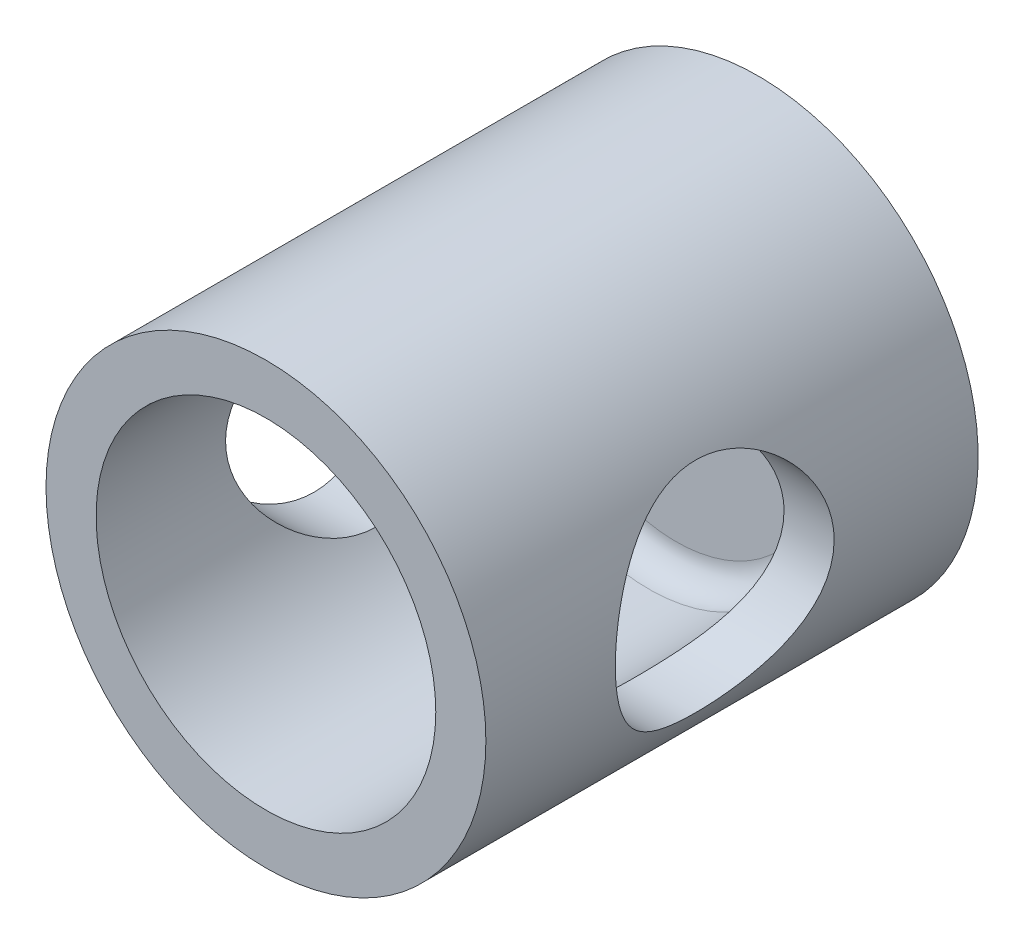
ISO-10303-21;
HEADER;
FILE_DESCRIPTION(('STEP AP214'),'2;1');
FILE_NAME('part.step','',(''),(''),'','','');
FILE_SCHEMA(('AUTOMOTIVE_DESIGN { 1 0 10303 214 1 1 1 1 }'));
ENDSEC;
DATA;
#1=APPLICATION_CONTEXT('core data for automotive mechanical design processes');
#2=APPLICATION_PROTOCOL_DEFINITION('international standard','automotive_design',2000,#1);
#3=PRODUCT_CONTEXT('',#1,'mechanical');
#4=PRODUCT('Part','Part','',(#3));
#5=PRODUCT_RELATED_PRODUCT_CATEGORY('part','',(#4));
#6=PRODUCT_DEFINITION_FORMATION('','',#4);
#7=PRODUCT_DEFINITION_CONTEXT('part definition',#1,'design');
#8=PRODUCT_DEFINITION('design','',#6,#7);
#9=PRODUCT_DEFINITION_SHAPE('','',#8);
#10=(LENGTH_UNIT() NAMED_UNIT(*) SI_UNIT(.MILLI.,.METRE.));
#11=(NAMED_UNIT(*) PLANE_ANGLE_UNIT() SI_UNIT($,.RADIAN.));
#12=(NAMED_UNIT(*) SI_UNIT($,.STERADIAN.) SOLID_ANGLE_UNIT());
#13=UNCERTAINTY_MEASURE_WITH_UNIT(LENGTH_MEASURE(1.E-05),#10,'distance_accuracy_value','');
#14=(GEOMETRIC_REPRESENTATION_CONTEXT(3) GLOBAL_UNCERTAINTY_ASSIGNED_CONTEXT((#13)) GLOBAL_UNIT_ASSIGNED_CONTEXT((#10,
#11,#12)) REPRESENTATION_CONTEXT('',''));
#15=CARTESIAN_POINT('',(0.,0.,0.));
#16=DIRECTION('',(0.,0.,1.));
#17=DIRECTION('',(1.,0.,0.));
#18=AXIS2_PLACEMENT_3D('',#15,#16,#17);
#19=CARTESIAN_POINT('',(-21.,0.,9.26602700813621));
#20=DIRECTION('',(1.,0.,0.));
#21=DIRECTION('',(0.,0.,-1.));
#22=AXIS2_PLACEMENT_3D('',#19,#20,#21);
#23=CYLINDRICAL_SURFACE('',#22,4.);
#24=CARTESIAN_POINT('',(-6.21027153803007,0.,5.26602700813621));
#25=CARTESIAN_POINT('',(-6.21027419475745,0.10116179511137,5.26602419368673));
#26=CARTESIAN_POINT('',(-6.20779578951268,0.202296836657,5.26986785153655));
#27=CARTESIAN_POINT('',(-6.1979513499279,0.403779242184816,5.28517721498518));
#28=CARTESIAN_POINT('',(-6.19058433900414,0.504126444728934,5.29664444352528));
#29=CARTESIAN_POINT('',(-6.17113313025147,0.703280502086392,5.32704890353996));
#30=CARTESIAN_POINT('',(-6.15904600541067,0.802086361476096,5.34599077022403));
#31=CARTESIAN_POINT('',(-6.13045066881727,0.997402959620375,5.39107522828379));
#32=CARTESIAN_POINT('',(-6.1139406187714,1.09391272585213,5.41722081385854));
#33=CARTESIAN_POINT('',(-6.05850504948021,1.37803111894126,5.50568715338015));
#34=CARTESIAN_POINT('',(-6.01355262412691,1.56140490993851,5.57822197187787));
#35=CARTESIAN_POINT('',(-5.91125922641458,1.91260612200056,5.74749820780275));
#36=CARTESIAN_POINT('',(-5.85391741903108,2.08043249410441,5.84424125689536));
#37=CARTESIAN_POINT('',(-5.72592839409287,2.41147736878317,6.06791891252311));
#38=CARTESIAN_POINT('',(-5.6545748203039,2.57318229013404,6.1966819596737));
#39=CARTESIAN_POINT('',(-5.50767741856737,2.87420381321784,6.47653387813265));
#40=CARTESIAN_POINT('',(-5.43212790981473,3.01348901585702,6.62765350171328));
#41=CARTESIAN_POINT('',(-5.31494961654037,3.21339900119603,6.88109880899431));
#42=CARTESIAN_POINT('',(-5.27260427658279,3.28222562504596,6.9767250943138));
#43=CARTESIAN_POINT('',(-5.18988119137982,3.41152430600391,7.17426605192657));
#44=CARTESIAN_POINT('',(-5.14950385022683,3.47199465194262,7.27618200603341));
#45=CARTESIAN_POINT('',(-5.03353859027783,3.63997393581471,7.59065525591866));
#46=CARTESIAN_POINT('',(-4.9628689263148,3.73445451394399,7.81244584783822));
#47=CARTESIAN_POINT('',(-4.86328418910194,3.8627299502056,8.21218554453294));
#48=CARTESIAN_POINT('',(-4.82823753706474,3.90604907652248,8.38558532510471));
#49=CARTESIAN_POINT('',(-4.77646449604497,3.96920260343946,8.73919781012551));
#50=CARTESIAN_POINT('',(-4.75970971604694,3.98907340233482,8.91939950613832));
#51=CARTESIAN_POINT('',(-4.74708301956282,4.00409757987669,9.28217311228656));
#52=CARTESIAN_POINT('',(-4.7512785570492,3.99917111809616,9.46475078826483));
#53=CARTESIAN_POINT('',(-4.78001287876579,3.96477098356035,9.82600361684351));
#54=CARTESIAN_POINT('',(-4.80456854952988,3.93527693454834,10.0046754036351));
#55=CARTESIAN_POINT('',(-4.86930393027865,3.85485067083263,10.347801837806));
#56=CARTESIAN_POINT('',(-4.9089616785873,3.80463040273523,10.512527957525));
#57=CARTESIAN_POINT('',(-4.99946437929397,3.68489450547158,10.8314678560019));
#58=CARTESIAN_POINT('',(-5.05031303161553,3.61537249279258,10.9856781358864));
#59=CARTESIAN_POINT('',(-5.16943092655625,3.44345588171677,11.3112153310293));
#60=CARTESIAN_POINT('',(-5.23916357829582,3.337294498445,11.4800146104514));
#61=CARTESIAN_POINT('',(-5.38188438130507,3.10190037606515,11.7993301567222));
#62=CARTESIAN_POINT('',(-5.45487634309922,2.9726400721355,11.9498242146197));
#63=CARTESIAN_POINT('',(-5.61187461512408,2.66631127958272,12.2570516185796));
#64=CARTESIAN_POINT('',(-5.6953851249832,2.48482286786562,12.409679782982));
#65=CARTESIAN_POINT('',(-5.85026918109212,2.09423349887556,12.6822708120702));
#66=CARTESIAN_POINT('',(-5.92165547025048,1.8851619482464,12.802268053573));
#67=CARTESIAN_POINT('',(-6.03223858750268,1.48772175089167,12.9841614162442));
#68=CARTESIAN_POINT('',(-6.07501102606718,1.30346190247884,13.0528591475138));
#69=CARTESIAN_POINT('',(-6.14416390327499,0.924015259424038,13.1628362983269));
#70=CARTESIAN_POINT('',(-6.17055763757704,0.728837468276994,13.2041379589233));
#71=CARTESIAN_POINT('',(-6.20458655584817,0.332151140464263,13.2572479047391));
#72=CARTESIAN_POINT('',(-6.21215622149502,0.130622957770149,13.2689531802926));
#73=CARTESIAN_POINT('',(-6.20758584553991,-0.271680719378584,13.2618571585236));
#74=CARTESIAN_POINT('',(-6.19544498822973,-0.472456182337687,13.2430545986526));
#75=CARTESIAN_POINT('',(-6.15386506618864,-0.855905836514246,13.1779519872883));
#76=CARTESIAN_POINT('',(-6.12542644934345,-1.03896553114524,13.1332407239176));
#77=CARTESIAN_POINT('',(-6.05440022046401,-1.39449139464518,13.0197244846093));
#78=CARTESIAN_POINT('',(-6.01181023775633,-1.56695578282124,12.95091547165));
#79=CARTESIAN_POINT('',(-5.91208724832325,-1.91021496490886,12.7859607499495));
#80=CARTESIAN_POINT('',(-5.85412478444299,-2.07998553522502,12.6881969830567));
#81=CARTESIAN_POINT('',(-5.72975444546384,-2.40149104860395,12.4707995946616));
#82=CARTESIAN_POINT('',(-5.66334023149179,-2.55321228756366,12.3511495285104));
#83=CARTESIAN_POINT('',(-5.51610020892713,-2.85886489252187,12.0724489386876));
#84=CARTESIAN_POINT('',(-5.43462887202774,-3.00954741402491,11.9101688869046));
#85=CARTESIAN_POINT('',(-5.27411247674773,-3.28272952122645,11.5622546495967));
#86=CARTESIAN_POINT('',(-5.19506806440456,-3.4052216581689,11.3766143115712));
#87=CARTESIAN_POINT('',(-5.05785169733432,-3.60532757449489,11.0094079507564));
#88=CARTESIAN_POINT('',(-4.9983022369782,-3.68670296295454,10.8304412660524));
#89=CARTESIAN_POINT('',(-4.9206127767023,-3.78904738889028,10.5516890632479));
#90=CARTESIAN_POINT('',(-4.89665691923493,-3.8198740119591,10.457062924984));
#91=CARTESIAN_POINT('',(-4.85347760963172,-3.87458938562093,10.264793145061));
#92=CARTESIAN_POINT('',(-4.83425177278955,-3.89848163337303,10.1671510520018));
#93=CARTESIAN_POINT('',(-4.80115820657488,-3.93916884289533,9.96841039593383));
#94=CARTESIAN_POINT('',(-4.78734813760506,-3.95588759781292,9.8672864821669));
#95=CARTESIAN_POINT('',(-4.76603542881081,-3.98153974002648,9.66339021393728));
#96=CARTESIAN_POINT('',(-4.7585326062632,-3.99047335286108,9.56061790731703));
#97=CARTESIAN_POINT('',(-4.75023262253051,-4.00035101775833,9.35448426897167));
#98=CARTESIAN_POINT('',(-4.74943062350589,-4.00130083394043,9.25112341612525));
#99=CARTESIAN_POINT('',(-4.75454904760025,-3.99521470319305,9.04483896272276));
#100=CARTESIAN_POINT('',(-4.76046887184919,-3.98817946767896,8.94191532403378));
#101=CARTESIAN_POINT('',(-4.78513764369516,-3.95860839154636,8.66622204257323));
#102=CARTESIAN_POINT('',(-4.80994912191195,-3.92869071937144,8.49471534470019));
#103=CARTESIAN_POINT('',(-4.87483310704924,-3.84786914809628,8.15980920941288));
#104=CARTESIAN_POINT('',(-4.91492089719386,-3.79694422801918,7.99641807688091));
#105=CARTESIAN_POINT('',(-5.02164784616665,-3.65524653088718,7.62561223601469));
#106=CARTESIAN_POINT('',(-5.0926767705326,-3.55679198573325,7.42239354474325));
#107=CARTESIAN_POINT('',(-5.2441982437604,-3.32934664618829,7.03767137723875));
#108=CARTESIAN_POINT('',(-5.32470518361578,-3.20030910700426,6.85620178926353));
#109=CARTESIAN_POINT('',(-5.48752737303865,-2.91242531443178,6.51499136281188));
#110=CARTESIAN_POINT('',(-5.56985254500375,-2.75321525567974,6.35556176795089));
#111=CARTESIAN_POINT('',(-5.72741114717448,-2.40834685435535,6.06435050698496));
#112=CARTESIAN_POINT('',(-5.80265114769249,-2.22271342446654,5.93254308409085));
#113=CARTESIAN_POINT('',(-5.93041544031859,-1.8523005741456,5.71510070068208));
#114=CARTESIAN_POINT('',(-5.98460240357186,-1.67030140279752,5.62575761407741));
#115=CARTESIAN_POINT('',(-6.05432278762509,-1.38642703943027,5.51259979882105));
#116=CARTESIAN_POINT('',(-6.07563222805987,-1.29001594354288,5.47836281229962));
#117=CARTESIAN_POINT('',(-6.11395227707634,-1.09408134914481,5.41719461834646));
#118=CARTESIAN_POINT('',(-6.13096387796168,-0.994558575045945,5.39026172440883));
#119=CARTESIAN_POINT('',(-6.16676738571439,-0.748345223170763,5.33382370214221));
#120=CARTESIAN_POINT('',(-6.18300637399467,-0.600300072240859,5.30846956799622));
#121=CARTESIAN_POINT('',(-6.20475680232674,-0.301483599157345,5.27457279848009));
#122=CARTESIAN_POINT('',(-6.21026758000435,-0.150712109255893,5.26603120113828));
#123=CARTESIAN_POINT('',(-6.21027153803007,0.,5.26602700813621));
#124=B_SPLINE_CURVE_WITH_KNOTS('',3,(#24,#25,#26,#27,#28,#29,#30,#31,#32,#33,#34,#35,#36,#37,
#38,#39,#40,#41,#42,#43,#44,#45,#46,#47,#48,#49,#50,#51,#52,#53,#54,#55,#56,#57,#58,#59,#60,#61,
#62,#63,#64,#65,#66,#67,#68,#69,#70,#71,#72,#73,#74,#75,#76,#77,#78,#79,#80,#81,#82,#83,#84,#85,
#86,#87,#88,#89,#90,#91,#92,#93,#94,#95,#96,#97,#98,#99,#100,#101,#102,#103,#104,#105,#106,#107,
#108,#109,#110,#111,#112,#113,#114,#115,#116,#117,#118,#119,#120,#121,#122,#123),.UNSPECIFIED.,
.T.,.F.,(4,2,2,2,2,2,2,2,2,2,2,2,2,2,2,2,2,2,2,2,2,2,2,2,2,2,2,2,2,2,2,2,2,2,2,2,2,2,2,2,2,2,2,
2,2,2,2,2,2,4),(0.,0.303336126772763,0.606732868446618,0.910318050420045,1.21402960730385,
1.81790901949754,2.42182914489841,3.07540722771112,3.72989283677029,4.10506873827853,
4.48032135350497,5.22876903870081,5.77300468699254,6.31639441493355,6.86153482679468,
7.40712782661394,7.93536190389105,8.46377088836157,9.09523846001963,9.72746468024955,
10.4780346484405,11.2278107972757,11.8289920955396,12.4296847352821,13.0324652144701,
13.6352706400046,14.2045233708391,14.7738715124838,15.3844260974564,15.995441331743,
16.7004290748437,17.4056028837979,18.0192370071596,18.3260030847592,18.6326141835282,
18.9424064020895,19.2521896455505,19.5617492133339,19.8712812035685,20.3963229210728,
20.9218913028077,21.628294194872,22.3357838367034,23.052420031869,23.7683849838101,
24.395067097135,24.7082464879726,25.0213535043906,25.4732395657141,25.9251535262078),.UNSPECIFIED.);
#125=CARTESIAN_POINT('',(-6.21027153803007,0.,5.26602700813621));
#126=VERTEX_POINT('',#125);
#127=EDGE_CURVE('E121',#126,#126,#124,.T.);
#128=ORIENTED_EDGE('',*,*,#127,.T.);
#129=EDGE_LOOP('',(#128));
#130=FACE_BOUND('',#129,.T.);
#131=CARTESIAN_POINT('',(-8.04212669637564,0.,5.26602700813621));
#132=CARTESIAN_POINT('',(-8.04212630414364,0.105257391885154,5.26602745614108));
#133=CARTESIAN_POINT('',(-8.0400552272396,0.210523337059257,5.27018673348386));
#134=CARTESIAN_POINT('',(-8.03182379375679,0.420279281347293,5.28677555528698));
#135=CARTESIAN_POINT('',(-8.02566163019231,0.524768916943047,5.29920875424864));
#136=CARTESIAN_POINT('',(-8.00939313360465,0.732301468596946,5.33222667498201));
#137=CARTESIAN_POINT('',(-7.99928108474102,0.835342062876286,5.35282321047517));
#138=CARTESIAN_POINT('',(-7.9753763105692,1.03909874101501,5.40192589415835));
#139=CARTESIAN_POINT('',(-7.96158208062805,1.13981385630429,5.43043527592869));
#140=CARTESIAN_POINT('',(-7.91529246465985,1.43658071246041,5.52713609530429));
#141=CARTESIAN_POINT('',(-7.87780328008354,1.62829732042591,5.60666951360139));
#142=CARTESIAN_POINT('',(-7.79296202979745,1.99528126781113,5.7930862618434));
#143=CARTESIAN_POINT('',(-7.74561080924149,2.17055001490891,5.89996724834382));
#144=CARTESIAN_POINT('',(-7.64205858722049,2.51164413707844,6.14539242426199));
#145=CARTESIAN_POINT('',(-7.58549690861226,2.67627045264003,6.28545255459696));
#146=CARTESIAN_POINT('',(-7.47109586233352,2.98078014207725,6.58994355143529));
#147=CARTESIAN_POINT('',(-7.41325556852754,3.12064487275159,6.75439261081889));
#148=CARTESIAN_POINT('',(-7.29772071024418,3.38246956238201,7.11828841503324));
#149=CARTESIAN_POINT('',(-7.24037608524739,3.50223999264779,7.31945040850877));
#150=CARTESIAN_POINT('',(-7.16389858978195,3.65480541730556,7.63624587567261));
#151=CARTESIAN_POINT('',(-7.13998951274712,3.70115663625523,7.74439232440346));
#152=CARTESIAN_POINT('',(-7.09624334870005,3.78435477721017,7.96505316273665));
#153=CARTESIAN_POINT('',(-7.07640386334476,3.82120730041102,8.07756493294796));
#154=CARTESIAN_POINT('',(-7.04265141642954,3.8830440926528,8.2993652330672));
#155=CARTESIAN_POINT('',(-7.02845767641738,3.90860067166185,8.40845179017485));
#156=CARTESIAN_POINT('',(-7.00498417233291,3.9505161417328,8.62885043333387));
#157=CARTESIAN_POINT('',(-6.99570181429245,3.96687988831243,8.74016131229567));
#158=CARTESIAN_POINT('',(-6.98244491458214,3.99016863652192,8.96401663973964));
#159=CARTESIAN_POINT('',(-6.97846725433724,3.99709918387807,9.07656032419477));
#160=CARTESIAN_POINT('',(-6.97598733542238,4.00142594974986,9.30188481539609));
#161=CARTESIAN_POINT('',(-6.97748456401485,3.99882306109656,9.41466559894868));
#162=CARTESIAN_POINT('',(-6.9853878617997,3.98499824234287,9.62608784934883));
#163=CARTESIAN_POINT('',(-6.99119181548553,3.97483315476114,9.72482257860045));
#164=CARTESIAN_POINT('',(-7.00679415205635,3.94726227845358,9.92096567715963));
#165=CARTESIAN_POINT('',(-7.01659379135194,3.92985421219725,10.0183736193048));
#166=CARTESIAN_POINT('',(-7.05153802190969,3.86703716999606,10.3075933855507));
#167=CARTESIAN_POINT('',(-7.08223412788531,3.81102541890858,10.4965478185559));
#168=CARTESIAN_POINT('',(-7.15565251701587,3.6713399237033,10.8664484379253));
#169=CARTESIAN_POINT('',(-7.19863844441127,3.58705182948358,11.0471052936798));
#170=CARTESIAN_POINT('',(-7.29180624888069,3.39365155775164,11.3926053378956));
#171=CARTESIAN_POINT('',(-7.34199135185085,3.28452823883726,11.5574413816071));
#172=CARTESIAN_POINT('',(-7.4514966189966,3.02864746431238,11.8883105603497));
#173=CARTESIAN_POINT('',(-7.51117350254039,2.87888771772847,12.0519058298397));
#174=CARTESIAN_POINT('',(-7.62786293929434,2.55367914950725,12.3527300015022));
#175=CARTESIAN_POINT('',(-7.68487423514056,2.37821836272971,12.4899465538616));
#176=CARTESIAN_POINT('',(-7.76530127835092,2.09433222438204,12.6759236124232));
#177=CARTESIAN_POINT('',(-7.79177849614505,1.99381419765517,12.7356734749219));
#178=CARTESIAN_POINT('',(-7.84170986949508,1.7873560899409,12.8463983619705));
#179=CARTESIAN_POINT('',(-7.86516529716083,1.68141831696652,12.8973770820387));
#180=CARTESIAN_POINT('',(-7.90836060308644,1.46486328148671,12.9900091570882));
#181=CARTESIAN_POINT('',(-7.92810195625671,1.35424789798927,13.0316662150807));
#182=CARTESIAN_POINT('',(-7.96327905157377,1.12914028513531,13.1051746577255));
#183=CARTESIAN_POINT('',(-7.97871528315954,1.01464849813882,13.1370271570772));
#184=CARTESIAN_POINT('',(-8.0037192923607,0.792305726931952,13.1882939359019));
#185=CARTESIAN_POINT('',(-8.01366528769422,0.684682950607484,13.2085156979449));
#186=CARTESIAN_POINT('',(-8.02924289618175,0.467837854718372,13.2400840166597));
#187=CARTESIAN_POINT('',(-8.03487488536638,0.358615675411765,13.2514313468738));
#188=CARTESIAN_POINT('',(-8.04166322825165,0.139510300162237,13.265099516041));
#189=CARTESIAN_POINT('',(-8.0428212706585,0.0296273693106928,13.2674237607897));
#190=CARTESIAN_POINT('',(-8.04063349836076,-0.1899080453328,13.263024475879));
#191=CARTESIAN_POINT('',(-8.03728787893605,-0.299560538910089,13.2563013385165));
#192=CARTESIAN_POINT('',(-8.0266147205239,-0.509334558441473,13.2347576448001));
#193=CARTESIAN_POINT('',(-8.01961285570956,-0.609541095314824,13.2205988878595));
#194=CARTESIAN_POINT('',(-8.00202643957596,-0.808302869973547,13.1848100995136));
#195=CARTESIAN_POINT('',(-7.99144066936683,-0.906857533971214,13.1631775262043));
#196=CARTESIAN_POINT('',(-7.95465824868384,-1.19899386648961,13.0873871728321));
#197=CARTESIAN_POINT('',(-7.9234262119682,-1.38923685467228,13.022316915832));
#198=CARTESIAN_POINT('',(-7.84925253208062,-1.76129447288519,12.8632526041543));
#199=CARTESIAN_POINT('',(-7.80599945863271,-1.9427083779424,12.7684792652243));
#200=CARTESIAN_POINT('',(-7.71195491872007,-2.28769339501647,12.5535453581402));
#201=CARTESIAN_POINT('',(-7.66116022940148,-2.45125682666088,12.4333739269551));
#202=CARTESIAN_POINT('',(-7.55111678115345,-2.77273461526583,12.1575832443003));
#203=CARTESIAN_POINT('',(-7.49152649054433,-2.92854660535335,11.9996512650671));
#204=CARTESIAN_POINT('',(-7.374251311014,-3.21245148901366,11.6595990948263));
#205=CARTESIAN_POINT('',(-7.31656772818038,-3.34052570260783,11.4774627357832));
#206=CARTESIAN_POINT('',(-7.23510207810912,-3.51188985705486,11.1844327930846));
#207=CARTESIAN_POINT('',(-7.20824873549052,-3.56652540729615,11.0808765624059));
#208=CARTESIAN_POINT('',(-7.15778447495172,-3.66675165107199,10.8687355019968));
#209=CARTESIAN_POINT('',(-7.13417209047954,-3.71234643978308,10.7601529766365));
#210=CARTESIAN_POINT('',(-7.09110965278487,-3.79395534744157,10.5387464425062));
#211=CARTESIAN_POINT('',(-7.07165624107782,-3.82997720255287,10.4259259432443));
#212=CARTESIAN_POINT('',(-7.03771160455857,-3.89200092493011,10.1968346045623));
#213=CARTESIAN_POINT('',(-7.02321962128591,-3.91800432380764,10.0805642954752));
#214=CARTESIAN_POINT('',(-7.00097907064348,-3.9575949364253,9.85686013674207));
#215=CARTESIAN_POINT('',(-6.99271811432712,-3.97213179381514,9.74964471723861));
#216=CARTESIAN_POINT('',(-6.98112494835889,-3.99247223122132,9.53412914356845));
#217=CARTESIAN_POINT('',(-6.97779223384346,-3.99827670580964,9.42582910165819));
#218=CARTESIAN_POINT('',(-6.9761961689014,-4.00106169533624,9.20910906816204));
#219=CARTESIAN_POINT('',(-6.97793109481366,-3.99804521055498,9.1006891298962));
#220=CARTESIAN_POINT('',(-6.98638326819771,-3.98325365490368,8.88467629238229));
#221=CARTESIAN_POINT('',(-6.9931003196188,-3.97147892867753,8.77708336075916));
#222=CARTESIAN_POINT('',(-7.0186605996709,-3.92624626304087,8.47687264741142));
#223=CARTESIAN_POINT('',(-7.04292063200615,-3.88294684092233,8.28609642533206));
#224=CARTESIAN_POINT('',(-7.10406940445188,-3.76988793226454,7.9148376877015));
#225=CARTESIAN_POINT('',(-7.14096217400177,-3.70012000234987,7.73435847802286));
#226=CARTESIAN_POINT('',(-7.22623261000789,-3.53085202193173,7.37523903597184));
#227=CARTESIAN_POINT('',(-7.2752156556788,-3.42966842243502,7.19753818203283));
#228=CARTESIAN_POINT('',(-7.37811632217331,-3.20230482303924,6.86048734579731));
#229=CARTESIAN_POINT('',(-7.43203648727754,-3.07611189545747,6.70114692192073));
#230=CARTESIAN_POINT('',(-7.54645954833433,-2.78461974444776,6.3855039157789));
#231=CARTESIAN_POINT('',(-7.60697738787587,-2.61644698841476,6.23185084681412));
#232=CARTESIAN_POINT('',(-7.7218685115483,-2.25486602390285,5.95431399310087));
#233=CARTESIAN_POINT('',(-7.77623851602615,-2.06144446350109,5.8304460583491));
#234=CARTESIAN_POINT('',(-7.84893305323637,-1.75534281560153,5.66988836650544));
#235=CARTESIAN_POINT('',(-7.87175337643136,-1.65024242790852,5.62044544353605));
#236=CARTESIAN_POINT('',(-7.91372177625741,-1.43552837315874,5.5306859620479));
#237=CARTESIAN_POINT('',(-7.93287165525197,-1.3259169535212,5.49036492248539));
#238=CARTESIAN_POINT('',(-7.966890365293,-1.10323411640381,5.41940432348408));
#239=CARTESIAN_POINT('',(-7.98176857695036,-0.990170893116456,5.3887435354099));
#240=CARTESIAN_POINT('',(-8.00683356797114,-0.76134521360523,5.33740301646327));
#241=CARTESIAN_POINT('',(-8.01702323258038,-0.645584463600059,5.31671714683187));
#242=CARTESIAN_POINT('',(-8.03048049393263,-0.441463283448409,5.28948152888501));
#243=CARTESIAN_POINT('',(-8.03484042130274,-0.353465746822281,5.28069338259122));
#244=CARTESIAN_POINT('',(-8.04066372726191,-0.176980830989061,5.26896585341181));
#245=CARTESIAN_POINT('',(-8.04212702613832,-0.0884934383687595,5.2660266314834));
#246=CARTESIAN_POINT('',(-8.04212669637564,0.,5.26602700813621));
#247=B_SPLINE_CURVE_WITH_KNOTS('',3,(#131,#132,#133,#134,#135,#136,#137,#138,#139,#140,#141,
#142,#143,#144,#145,#146,#147,#148,#149,#150,#151,#152,#153,#154,#155,#156,#157,#158,#159,#160,
#161,#162,#163,#164,#165,#166,#167,#168,#169,#170,#171,#172,#173,#174,#175,#176,#177,#178,#179,
#180,#181,#182,#183,#184,#185,#186,#187,#188,#189,#190,#191,#192,#193,#194,#195,#196,#197,#198,
#199,#200,#201,#202,#203,#204,#205,#206,#207,#208,#209,#210,#211,#212,#213,#214,#215,#216,#217,
#218,#219,#220,#221,#222,#223,#224,#225,#226,#227,#228,#229,#230,#231,#232,#233,#234,#235,#236,
#237,#238,#239,#240,#241,#242,#243,#244,#245,#246),.UNSPECIFIED.,.T.,.F.,(4,2,2,2,2,2,2,2,2,2,2,
2,2,2,2,2,2,2,2,2,2,2,2,2,2,2,2,2,2,2,2,2,2,2,2,2,2,2,2,2,2,2,2,2,2,2,2,2,2,2,2,2,2,2,2,2,2,4),
(0.,0.315684493303016,0.631508513646138,0.947791263148423,1.26420345220552,1.89388653113079,
2.52351566985077,3.19095332556495,3.85889138305106,4.57794862660702,4.93772123844638,
5.29728121151059,5.63560961233947,5.97375914470579,6.31170979481885,6.64962879578469,
6.94754333664611,7.2455516266249,7.84113229538662,8.4505955541839,9.06033276689204,
9.74646884174019,10.4329253690748,10.792210388511,11.1513436588277,11.5103340099204,
11.8692835316065,12.1987132878459,12.5281143260512,12.8573910185757,13.1866534340408,
13.4906190130669,13.7946880751186,14.4022622839729,15.0273406817056,15.6526869750497,
16.3389496652068,17.0256730910165,17.3856426847037,17.7454488492797,18.1049633537655,
18.4644228742026,18.7895030561583,19.1145499336385,19.439486265507,19.7644098115447,
20.3529573467801,20.9416927850109,21.5700089270551,22.1986507059148,22.9025842404173,
23.6068915444036,23.9615921723814,24.3161181766492,24.6698595780523,25.0233830013894,
25.2887822955332,25.5541888931293),.UNSPECIFIED.);
#248=CARTESIAN_POINT('',(-8.04212669637564,0.,5.26602700813621));
#249=VERTEX_POINT('',#248);
#250=EDGE_CURVE('E82',#249,#249,#247,.T.);
#251=ORIENTED_EDGE('',*,*,#250,.F.);
#252=EDGE_LOOP('',(#251));
#253=FACE_BOUND('',#252,.T.);
#254=ADVANCED_FACE('F64',(#130,#253),#23,.F.);
#255=CARTESIAN_POINT('',(6.21027153803007,0.,5.26602700813621));
#256=CARTESIAN_POINT('',(6.21027419475745,-0.10116179511137,5.26602419368673));
#257=CARTESIAN_POINT('',(6.20779578951268,-0.202296836657,5.26986785153655));
#258=CARTESIAN_POINT('',(6.1979513499279,-0.403779242184816,5.28517721498518));
#259=CARTESIAN_POINT('',(6.19058433900414,-0.504126444728934,5.29664444352528));
#260=CARTESIAN_POINT('',(6.17113313025147,-0.703280502086392,5.32704890353996));
#261=CARTESIAN_POINT('',(6.15904600541067,-0.802086361476096,5.34599077022403));
#262=CARTESIAN_POINT('',(6.13045066881727,-0.997402959620375,5.39107522828379));
#263=CARTESIAN_POINT('',(6.1139406187714,-1.09391272585213,5.41722081385854));
#264=CARTESIAN_POINT('',(6.05850504948021,-1.37803111894126,5.50568715338015));
#265=CARTESIAN_POINT('',(6.01355262412691,-1.56140490993851,5.57822197187787));
#266=CARTESIAN_POINT('',(5.91125922641458,-1.91260612200056,5.74749820780275));
#267=CARTESIAN_POINT('',(5.85391741903108,-2.08043249410441,5.84424125689536));
#268=CARTESIAN_POINT('',(5.72592839409287,-2.41147736878317,6.06791891252311));
#269=CARTESIAN_POINT('',(5.6545748203039,-2.57318229013404,6.1966819596737));
#270=CARTESIAN_POINT('',(5.50767741856737,-2.87420381321784,6.47653387813265));
#271=CARTESIAN_POINT('',(5.43212790981473,-3.01348901585702,6.62765350171328));
#272=CARTESIAN_POINT('',(5.31494961654037,-3.21339900119603,6.88109880899431));
#273=CARTESIAN_POINT('',(5.27260427658279,-3.28222562504596,6.9767250943138));
#274=CARTESIAN_POINT('',(5.18988119137982,-3.41152430600391,7.17426605192657));
#275=CARTESIAN_POINT('',(5.14950385022683,-3.47199465194262,7.27618200603341));
#276=CARTESIAN_POINT('',(5.03353859027783,-3.63997393581471,7.59065525591866));
#277=CARTESIAN_POINT('',(4.9628689263148,-3.73445451394399,7.81244584783822));
#278=CARTESIAN_POINT('',(4.86328418910194,-3.8627299502056,8.21218554453294));
#279=CARTESIAN_POINT('',(4.82823753706474,-3.90604907652248,8.38558532510471));
#280=CARTESIAN_POINT('',(4.77646449604497,-3.96920260343946,8.73919781012551));
#281=CARTESIAN_POINT('',(4.75970971604694,-3.98907340233482,8.91939950613832));
#282=CARTESIAN_POINT('',(4.74708301956282,-4.00409757987669,9.28217311228656));
#283=CARTESIAN_POINT('',(4.7512785570492,-3.99917111809616,9.46475078826483));
#284=CARTESIAN_POINT('',(4.78001287876579,-3.96477098356035,9.82600361684351));
#285=CARTESIAN_POINT('',(4.80456854952988,-3.93527693454834,10.0046754036351));
#286=CARTESIAN_POINT('',(4.86930393027865,-3.85485067083263,10.347801837806));
#287=CARTESIAN_POINT('',(4.9089616785873,-3.80463040273523,10.512527957525));
#288=CARTESIAN_POINT('',(4.99946437929397,-3.68489450547158,10.8314678560019));
#289=CARTESIAN_POINT('',(5.05031303161553,-3.61537249279258,10.9856781358864));
#290=CARTESIAN_POINT('',(5.16943092655625,-3.44345588171677,11.3112153310293));
#291=CARTESIAN_POINT('',(5.23916357829582,-3.337294498445,11.4800146104514));
#292=CARTESIAN_POINT('',(5.38188438130507,-3.10190037606515,11.7993301567222));
#293=CARTESIAN_POINT('',(5.45487634309922,-2.9726400721355,11.9498242146197));
#294=CARTESIAN_POINT('',(5.61187461512408,-2.66631127958272,12.2570516185796));
#295=CARTESIAN_POINT('',(5.6953851249832,-2.48482286786562,12.409679782982));
#296=CARTESIAN_POINT('',(5.85026918109212,-2.09423349887556,12.6822708120702));
#297=CARTESIAN_POINT('',(5.92165547025048,-1.8851619482464,12.802268053573));
#298=CARTESIAN_POINT('',(6.03223858750268,-1.48772175089167,12.9841614162442));
#299=CARTESIAN_POINT('',(6.07501102606718,-1.30346190247884,13.0528591475138));
#300=CARTESIAN_POINT('',(6.14416390327499,-0.924015259424038,13.1628362983269));
#301=CARTESIAN_POINT('',(6.17055763757704,-0.728837468276994,13.2041379589233));
#302=CARTESIAN_POINT('',(6.20458655584817,-0.332151140464263,13.2572479047391));
#303=CARTESIAN_POINT('',(6.21215622149502,-0.130622957770149,13.2689531802926));
#304=CARTESIAN_POINT('',(6.20758584553991,0.271680719378584,13.2618571585236));
#305=CARTESIAN_POINT('',(6.19544498822973,0.472456182337687,13.2430545986526));
#306=CARTESIAN_POINT('',(6.15386506618864,0.855905836514246,13.1779519872883));
#307=CARTESIAN_POINT('',(6.12542644934345,1.03896553114524,13.1332407239176));
#308=CARTESIAN_POINT('',(6.05440022046401,1.39449139464518,13.0197244846093));
#309=CARTESIAN_POINT('',(6.01181023775633,1.56695578282124,12.95091547165));
#310=CARTESIAN_POINT('',(5.91208724832325,1.91021496490886,12.7859607499495));
#311=CARTESIAN_POINT('',(5.85412478444299,2.07998553522502,12.6881969830567));
#312=CARTESIAN_POINT('',(5.72975444546384,2.40149104860395,12.4707995946616));
#313=CARTESIAN_POINT('',(5.66334023149179,2.55321228756366,12.3511495285104));
#314=CARTESIAN_POINT('',(5.51610020892713,2.85886489252187,12.0724489386876));
#315=CARTESIAN_POINT('',(5.43462887202774,3.00954741402491,11.9101688869046));
#316=CARTESIAN_POINT('',(5.27411247674773,3.28272952122645,11.5622546495967));
#317=CARTESIAN_POINT('',(5.19506806440456,3.4052216581689,11.3766143115712));
#318=CARTESIAN_POINT('',(5.05785169733432,3.60532757449489,11.0094079507564));
#319=CARTESIAN_POINT('',(4.9983022369782,3.68670296295454,10.8304412660524));
#320=CARTESIAN_POINT('',(4.9206127767023,3.78904738889028,10.5516890632479));
#321=CARTESIAN_POINT('',(4.89665691923493,3.8198740119591,10.457062924984));
#322=CARTESIAN_POINT('',(4.85347760963172,3.87458938562093,10.264793145061));
#323=CARTESIAN_POINT('',(4.83425177278955,3.89848163337303,10.1671510520018));
#324=CARTESIAN_POINT('',(4.80115820657488,3.93916884289533,9.96841039593383));
#325=CARTESIAN_POINT('',(4.78734813760506,3.95588759781292,9.8672864821669));
#326=CARTESIAN_POINT('',(4.76603542881081,3.98153974002648,9.66339021393728));
#327=CARTESIAN_POINT('',(4.7585326062632,3.99047335286108,9.56061790731703));
#328=CARTESIAN_POINT('',(4.75023262253051,4.00035101775833,9.35448426897167));
#329=CARTESIAN_POINT('',(4.74943062350589,4.00130083394043,9.25112341612525));
#330=CARTESIAN_POINT('',(4.75454904760025,3.99521470319305,9.04483896272276));
#331=CARTESIAN_POINT('',(4.76046887184919,3.98817946767896,8.94191532403378));
#332=CARTESIAN_POINT('',(4.78513764369516,3.95860839154636,8.66622204257323));
#333=CARTESIAN_POINT('',(4.80994912191195,3.92869071937144,8.49471534470019));
#334=CARTESIAN_POINT('',(4.87483310704924,3.84786914809628,8.15980920941288));
#335=CARTESIAN_POINT('',(4.91492089719386,3.79694422801918,7.99641807688091));
#336=CARTESIAN_POINT('',(5.02164784616665,3.65524653088718,7.62561223601469));
#337=CARTESIAN_POINT('',(5.0926767705326,3.55679198573325,7.42239354474325));
#338=CARTESIAN_POINT('',(5.2441982437604,3.32934664618829,7.03767137723875));
#339=CARTESIAN_POINT('',(5.32470518361578,3.20030910700426,6.85620178926353));
#340=CARTESIAN_POINT('',(5.48752737303865,2.91242531443178,6.51499136281188));
#341=CARTESIAN_POINT('',(5.56985254500375,2.75321525567974,6.35556176795089));
#342=CARTESIAN_POINT('',(5.72741114717448,2.40834685435535,6.06435050698496));
#343=CARTESIAN_POINT('',(5.80265114769249,2.22271342446654,5.93254308409085));
#344=CARTESIAN_POINT('',(5.93041544031859,1.8523005741456,5.71510070068208));
#345=CARTESIAN_POINT('',(5.98460240357186,1.67030140279752,5.62575761407741));
#346=CARTESIAN_POINT('',(6.05432278762509,1.38642703943027,5.51259979882105));
#347=CARTESIAN_POINT('',(6.07563222805987,1.29001594354288,5.47836281229962));
#348=CARTESIAN_POINT('',(6.11395227707634,1.09408134914481,5.41719461834646));
#349=CARTESIAN_POINT('',(6.13096387796168,0.994558575045945,5.39026172440883));
#350=CARTESIAN_POINT('',(6.16676738571439,0.748345223170763,5.33382370214221));
#351=CARTESIAN_POINT('',(6.18300637399467,0.600300072240859,5.30846956799622));
#352=CARTESIAN_POINT('',(6.20475680232674,0.301483599157345,5.27457279848009));
#353=CARTESIAN_POINT('',(6.21026758000435,0.150712109255893,5.26603120113828));
#354=CARTESIAN_POINT('',(6.21027153803007,0.,5.26602700813621));
#355=B_SPLINE_CURVE_WITH_KNOTS('',3,(#255,#256,#257,#258,#259,#260,#261,#262,#263,#264,#265,
#266,#267,#268,#269,#270,#271,#272,#273,#274,#275,#276,#277,#278,#279,#280,#281,#282,#283,#284,
#285,#286,#287,#288,#289,#290,#291,#292,#293,#294,#295,#296,#297,#298,#299,#300,#301,#302,#303,
#304,#305,#306,#307,#308,#309,#310,#311,#312,#313,#314,#315,#316,#317,#318,#319,#320,#321,#322,
#323,#324,#325,#326,#327,#328,#329,#330,#331,#332,#333,#334,#335,#336,#337,#338,#339,#340,#341,
#342,#343,#344,#345,#346,#347,#348,#349,#350,#351,#352,#353,#354),.UNSPECIFIED.,.T.,.F.,(4,2,2,
2,2,2,2,2,2,2,2,2,2,2,2,2,2,2,2,2,2,2,2,2,2,2,2,2,2,2,2,2,2,2,2,2,2,2,2,2,2,2,2,2,2,2,2,2,2,4),
(0.,0.303336126772763,0.606732868446618,0.910318050420045,1.21402960730385,1.81790901949754,
2.42182914489841,3.07540722771112,3.72989283677029,4.10506873827853,4.48032135350497,
5.22876903870081,5.77300468699254,6.31639441493355,6.86153482679468,7.40712782661394,
7.93536190389105,8.46377088836157,9.09523846001963,9.72746468024955,10.4780346484405,
11.2278107972757,11.8289920955396,12.4296847352821,13.0324652144701,13.6352706400046,
14.2045233708391,14.7738715124838,15.3844260974564,15.995441331743,16.7004290748437,
17.4056028837979,18.0192370071596,18.3260030847592,18.6326141835282,18.9424064020895,
19.2521896455505,19.5617492133339,19.8712812035685,20.3963229210728,20.9218913028077,
21.628294194872,22.3357838367034,23.052420031869,23.7683849838101,24.395067097135,
24.7082464879726,25.0213535043906,25.4732395657141,25.9251535262078),.UNSPECIFIED.);
#356=CARTESIAN_POINT('',(6.21027153803007,0.,5.26602700813621));
#357=VERTEX_POINT('',#356);
#358=EDGE_CURVE('E115',#357,#357,#355,.T.);
#359=ORIENTED_EDGE('',*,*,#358,.T.);
#360=EDGE_LOOP('',(#359));
#361=FACE_BOUND('',#360,.T.);
#362=CARTESIAN_POINT('',(8.04212669637564,0.,5.26602700813621));
#363=CARTESIAN_POINT('',(8.04212630414364,-0.105257391885154,5.26602745614108));
#364=CARTESIAN_POINT('',(8.0400552272396,-0.210523337059257,5.27018673348386));
#365=CARTESIAN_POINT('',(8.03182379375679,-0.420279281347293,5.28677555528698));
#366=CARTESIAN_POINT('',(8.02566163019231,-0.524768916943047,5.29920875424864));
#367=CARTESIAN_POINT('',(8.00939313360465,-0.732301468596946,5.33222667498201));
#368=CARTESIAN_POINT('',(7.99928108474102,-0.835342062876286,5.35282321047517));
#369=CARTESIAN_POINT('',(7.9753763105692,-1.03909874101501,5.40192589415835));
#370=CARTESIAN_POINT('',(7.96158208062805,-1.13981385630429,5.43043527592869));
#371=CARTESIAN_POINT('',(7.91529246465985,-1.43658071246041,5.52713609530429));
#372=CARTESIAN_POINT('',(7.87780328008354,-1.62829732042591,5.60666951360139));
#373=CARTESIAN_POINT('',(7.79296202979745,-1.99528126781113,5.7930862618434));
#374=CARTESIAN_POINT('',(7.74561080924149,-2.17055001490891,5.89996724834382));
#375=CARTESIAN_POINT('',(7.64205858722049,-2.51164413707844,6.14539242426199));
#376=CARTESIAN_POINT('',(7.58549690861226,-2.67627045264003,6.28545255459696));
#377=CARTESIAN_POINT('',(7.47109586233352,-2.98078014207725,6.58994355143529));
#378=CARTESIAN_POINT('',(7.41325556852754,-3.12064487275159,6.75439261081889));
#379=CARTESIAN_POINT('',(7.29772071024418,-3.38246956238201,7.11828841503324));
#380=CARTESIAN_POINT('',(7.24037608524739,-3.50223999264779,7.31945040850877));
#381=CARTESIAN_POINT('',(7.16389858978195,-3.65480541730556,7.63624587567261));
#382=CARTESIAN_POINT('',(7.13998951274712,-3.70115663625523,7.74439232440346));
#383=CARTESIAN_POINT('',(7.09624334870005,-3.78435477721017,7.96505316273665));
#384=CARTESIAN_POINT('',(7.07640386334476,-3.82120730041102,8.07756493294796));
#385=CARTESIAN_POINT('',(7.04265141642954,-3.8830440926528,8.2993652330672));
#386=CARTESIAN_POINT('',(7.02845767641738,-3.90860067166185,8.40845179017485));
#387=CARTESIAN_POINT('',(7.00498417233291,-3.9505161417328,8.62885043333387));
#388=CARTESIAN_POINT('',(6.99570181429245,-3.96687988831243,8.74016131229567));
#389=CARTESIAN_POINT('',(6.98244491458214,-3.99016863652192,8.96401663973964));
#390=CARTESIAN_POINT('',(6.97846725433724,-3.99709918387807,9.07656032419477));
#391=CARTESIAN_POINT('',(6.97598733542238,-4.00142594974986,9.30188481539609));
#392=CARTESIAN_POINT('',(6.97748456401485,-3.99882306109656,9.41466559894868));
#393=CARTESIAN_POINT('',(6.9853878617997,-3.98499824234287,9.62608784934883));
#394=CARTESIAN_POINT('',(6.99119181548553,-3.97483315476114,9.72482257860045));
#395=CARTESIAN_POINT('',(7.00679415205635,-3.94726227845358,9.92096567715963));
#396=CARTESIAN_POINT('',(7.01659379135194,-3.92985421219725,10.0183736193048));
#397=CARTESIAN_POINT('',(7.05153802190969,-3.86703716999606,10.3075933855507));
#398=CARTESIAN_POINT('',(7.08223412788531,-3.81102541890858,10.4965478185559));
#399=CARTESIAN_POINT('',(7.15565251701587,-3.6713399237033,10.8664484379253));
#400=CARTESIAN_POINT('',(7.19863844441127,-3.58705182948358,11.0471052936798));
#401=CARTESIAN_POINT('',(7.29180624888069,-3.39365155775164,11.3926053378956));
#402=CARTESIAN_POINT('',(7.34199135185085,-3.28452823883726,11.5574413816071));
#403=CARTESIAN_POINT('',(7.4514966189966,-3.02864746431238,11.8883105603497));
#404=CARTESIAN_POINT('',(7.51117350254039,-2.87888771772847,12.0519058298397));
#405=CARTESIAN_POINT('',(7.62786293929434,-2.55367914950725,12.3527300015022));
#406=CARTESIAN_POINT('',(7.68487423514056,-2.37821836272971,12.4899465538616));
#407=CARTESIAN_POINT('',(7.76530127835092,-2.09433222438204,12.6759236124232));
#408=CARTESIAN_POINT('',(7.79177849614505,-1.99381419765517,12.7356734749219));
#409=CARTESIAN_POINT('',(7.84170986949508,-1.7873560899409,12.8463983619705));
#410=CARTESIAN_POINT('',(7.86516529716083,-1.68141831696652,12.8973770820387));
#411=CARTESIAN_POINT('',(7.90836060308644,-1.46486328148671,12.9900091570882));
#412=CARTESIAN_POINT('',(7.92810195625671,-1.35424789798927,13.0316662150807));
#413=CARTESIAN_POINT('',(7.96327905157377,-1.12914028513531,13.1051746577255));
#414=CARTESIAN_POINT('',(7.97871528315954,-1.01464849813882,13.1370271570772));
#415=CARTESIAN_POINT('',(8.0037192923607,-0.792305726931952,13.1882939359019));
#416=CARTESIAN_POINT('',(8.01366528769422,-0.684682950607484,13.2085156979449));
#417=CARTESIAN_POINT('',(8.02924289618175,-0.467837854718372,13.2400840166597));
#418=CARTESIAN_POINT('',(8.03487488536638,-0.358615675411765,13.2514313468738));
#419=CARTESIAN_POINT('',(8.04166322825165,-0.139510300162237,13.265099516041));
#420=CARTESIAN_POINT('',(8.0428212706585,-0.0296273693106928,13.2674237607897));
#421=CARTESIAN_POINT('',(8.04063349836076,0.1899080453328,13.263024475879));
#422=CARTESIAN_POINT('',(8.03728787893605,0.299560538910089,13.2563013385165));
#423=CARTESIAN_POINT('',(8.0266147205239,0.509334558441473,13.2347576448001));
#424=CARTESIAN_POINT('',(8.01961285570956,0.609541095314824,13.2205988878595));
#425=CARTESIAN_POINT('',(8.00202643957596,0.808302869973547,13.1848100995136));
#426=CARTESIAN_POINT('',(7.99144066936683,0.906857533971214,13.1631775262043));
#427=CARTESIAN_POINT('',(7.95465824868384,1.19899386648961,13.0873871728321));
#428=CARTESIAN_POINT('',(7.9234262119682,1.38923685467228,13.022316915832));
#429=CARTESIAN_POINT('',(7.84925253208062,1.76129447288519,12.8632526041543));
#430=CARTESIAN_POINT('',(7.80599945863271,1.9427083779424,12.7684792652243));
#431=CARTESIAN_POINT('',(7.71195491872007,2.28769339501647,12.5535453581402));
#432=CARTESIAN_POINT('',(7.66116022940148,2.45125682666088,12.4333739269551));
#433=CARTESIAN_POINT('',(7.55111678115345,2.77273461526583,12.1575832443003));
#434=CARTESIAN_POINT('',(7.49152649054433,2.92854660535335,11.9996512650671));
#435=CARTESIAN_POINT('',(7.374251311014,3.21245148901366,11.6595990948263));
#436=CARTESIAN_POINT('',(7.31656772818038,3.34052570260783,11.4774627357832));
#437=CARTESIAN_POINT('',(7.23510207810912,3.51188985705486,11.1844327930846));
#438=CARTESIAN_POINT('',(7.20824873549052,3.56652540729615,11.0808765624059));
#439=CARTESIAN_POINT('',(7.15778447495172,3.66675165107199,10.8687355019968));
#440=CARTESIAN_POINT('',(7.13417209047954,3.71234643978308,10.7601529766365));
#441=CARTESIAN_POINT('',(7.09110965278487,3.79395534744157,10.5387464425062));
#442=CARTESIAN_POINT('',(7.07165624107782,3.82997720255287,10.4259259432443));
#443=CARTESIAN_POINT('',(7.03771160455857,3.89200092493011,10.1968346045623));
#444=CARTESIAN_POINT('',(7.02321962128591,3.91800432380764,10.0805642954752));
#445=CARTESIAN_POINT('',(7.00097907064348,3.9575949364253,9.85686013674207));
#446=CARTESIAN_POINT('',(6.99271811432712,3.97213179381514,9.74964471723861));
#447=CARTESIAN_POINT('',(6.98112494835889,3.99247223122132,9.53412914356845));
#448=CARTESIAN_POINT('',(6.97779223384346,3.99827670580964,9.42582910165819));
#449=CARTESIAN_POINT('',(6.9761961689014,4.00106169533624,9.20910906816204));
#450=CARTESIAN_POINT('',(6.97793109481366,3.99804521055498,9.1006891298962));
#451=CARTESIAN_POINT('',(6.98638326819771,3.98325365490368,8.88467629238229));
#452=CARTESIAN_POINT('',(6.9931003196188,3.97147892867753,8.77708336075916));
#453=CARTESIAN_POINT('',(7.0186605996709,3.92624626304087,8.47687264741142));
#454=CARTESIAN_POINT('',(7.04292063200615,3.88294684092233,8.28609642533206));
#455=CARTESIAN_POINT('',(7.10406940445188,3.76988793226454,7.9148376877015));
#456=CARTESIAN_POINT('',(7.14096217400177,3.70012000234987,7.73435847802286));
#457=CARTESIAN_POINT('',(7.22623261000789,3.53085202193173,7.37523903597184));
#458=CARTESIAN_POINT('',(7.2752156556788,3.42966842243502,7.19753818203283));
#459=CARTESIAN_POINT('',(7.37811632217331,3.20230482303924,6.86048734579731));
#460=CARTESIAN_POINT('',(7.43203648727754,3.07611189545747,6.70114692192073));
#461=CARTESIAN_POINT('',(7.54645954833433,2.78461974444776,6.3855039157789));
#462=CARTESIAN_POINT('',(7.60697738787587,2.61644698841476,6.23185084681412));
#463=CARTESIAN_POINT('',(7.7218685115483,2.25486602390285,5.95431399310087));
#464=CARTESIAN_POINT('',(7.77623851602615,2.06144446350109,5.8304460583491));
#465=CARTESIAN_POINT('',(7.84893305323637,1.75534281560153,5.66988836650544));
#466=CARTESIAN_POINT('',(7.87175337643136,1.65024242790852,5.62044544353605));
#467=CARTESIAN_POINT('',(7.91372177625741,1.43552837315874,5.5306859620479));
#468=CARTESIAN_POINT('',(7.93287165525197,1.3259169535212,5.49036492248539));
#469=CARTESIAN_POINT('',(7.966890365293,1.10323411640381,5.41940432348408));
#470=CARTESIAN_POINT('',(7.98176857695036,0.990170893116456,5.3887435354099));
#471=CARTESIAN_POINT('',(8.00683356797114,0.76134521360523,5.33740301646327));
#472=CARTESIAN_POINT('',(8.01702323258038,0.645584463600059,5.31671714683187));
#473=CARTESIAN_POINT('',(8.03048049393263,0.441463283448409,5.28948152888501));
#474=CARTESIAN_POINT('',(8.03484042130274,0.353465746822281,5.28069338259122));
#475=CARTESIAN_POINT('',(8.04066372726191,0.176980830989061,5.26896585341181));
#476=CARTESIAN_POINT('',(8.04212702613832,0.0884934383687595,5.2660266314834));
#477=CARTESIAN_POINT('',(8.04212669637564,0.,5.26602700813621));
#478=B_SPLINE_CURVE_WITH_KNOTS('',3,(#362,#363,#364,#365,#366,#367,#368,#369,#370,#371,#372,
#373,#374,#375,#376,#377,#378,#379,#380,#381,#382,#383,#384,#385,#386,#387,#388,#389,#390,#391,
#392,#393,#394,#395,#396,#397,#398,#399,#400,#401,#402,#403,#404,#405,#406,#407,#408,#409,#410,
#411,#412,#413,#414,#415,#416,#417,#418,#419,#420,#421,#422,#423,#424,#425,#426,#427,#428,#429,
#430,#431,#432,#433,#434,#435,#436,#437,#438,#439,#440,#441,#442,#443,#444,#445,#446,#447,#448,
#449,#450,#451,#452,#453,#454,#455,#456,#457,#458,#459,#460,#461,#462,#463,#464,#465,#466,#467,
#468,#469,#470,#471,#472,#473,#474,#475,#476,#477),.UNSPECIFIED.,.T.,.F.,(4,2,2,2,2,2,2,2,2,2,2,
2,2,2,2,2,2,2,2,2,2,2,2,2,2,2,2,2,2,2,2,2,2,2,2,2,2,2,2,2,2,2,2,2,2,2,2,2,2,2,2,2,2,2,2,2,2,4),
(0.,0.315684493303016,0.631508513646138,0.947791263148423,1.26420345220552,1.89388653113079,
2.52351566985077,3.19095332556495,3.85889138305106,4.57794862660702,4.93772123844638,
5.29728121151059,5.63560961233947,5.97375914470579,6.31170979481885,6.64962879578469,
6.94754333664611,7.2455516266249,7.84113229538662,8.4505955541839,9.06033276689204,
9.74646884174019,10.4329253690748,10.792210388511,11.1513436588277,11.5103340099204,
11.8692835316065,12.1987132878459,12.5281143260512,12.8573910185757,13.1866534340408,
13.4906190130669,13.7946880751186,14.4022622839729,15.0273406817056,15.6526869750497,
16.3389496652068,17.0256730910165,17.3856426847037,17.7454488492797,18.1049633537655,
18.4644228742026,18.7895030561583,19.1145499336385,19.439486265507,19.7644098115447,
20.3529573467801,20.9416927850109,21.5700089270551,22.1986507059148,22.9025842404173,
23.6068915444036,23.9615921723814,24.3161181766492,24.6698595780523,25.0233830013894,
25.2887822955332,25.5541888931293),.UNSPECIFIED.);
#479=CARTESIAN_POINT('',(8.04212669637564,0.,5.26602700813621));
#480=VERTEX_POINT('',#479);
#481=EDGE_CURVE('E93',#480,#480,#478,.T.);
#482=ORIENTED_EDGE('',*,*,#481,.F.);
#483=EDGE_LOOP('',(#482));
#484=FACE_BOUND('',#483,.T.);
#485=ADVANCED_FACE('F97',(#361,#484),#23,.F.);
#486=CARTESIAN_POINT('',(0.,0.,24.));
#487=DIRECTION('',(0.,0.,-1.));
#488=DIRECTION('',(-1.,0.,0.));
#489=AXIS2_PLACEMENT_3D('',#486,#487,#488);
#490=CYLINDRICAL_SURFACE('',#489,8.04212669637564);
#491=CARTESIAN_POINT('',(0.,0.,18.));
#492=DIRECTION('',(0.,0.,1.));
#493=DIRECTION('',(1.,0.,0.));
#494=AXIS2_PLACEMENT_3D('',#491,#492,#493);
#495=CIRCLE('',#494,8.04212669637564);
#496=CARTESIAN_POINT('',(8.04212669637564,0.,18.));
#497=VERTEX_POINT('',#496);
#498=EDGE_CURVE('E77',#497,#497,#495,.T.);
#499=ORIENTED_EDGE('',*,*,#498,.F.);
#500=EDGE_LOOP('',(#499));
#501=FACE_BOUND('',#500,.T.);
#502=CARTESIAN_POINT('',(0.,0.,0.));
#503=DIRECTION('',(0.,0.,-1.));
#504=DIRECTION('',(-1.,0.,0.));
#505=AXIS2_PLACEMENT_3D('',#502,#503,#504);
#506=CIRCLE('',#505,8.04212669637564);
#507=CARTESIAN_POINT('',(-8.04212669637564,0.,0.));
#508=VERTEX_POINT('',#507);
#509=EDGE_CURVE('E128',#508,#508,#506,.T.);
#510=ORIENTED_EDGE('',*,*,#509,.F.);
#511=EDGE_LOOP('',(#510));
#512=FACE_BOUND('',#511,.T.);
#513=ORIENTED_EDGE('',*,*,#481,.T.);
#514=EDGE_LOOP('',(#513));
#515=FACE_BOUND('',#514,.T.);
#516=ORIENTED_EDGE('',*,*,#250,.T.);
#517=EDGE_LOOP('',(#516));
#518=FACE_BOUND('',#517,.T.);
#519=ADVANCED_FACE('F100',(#501,#512,#515,#518),#490,.T.);
#520=CARTESIAN_POINT('',(0.,0.,0.));
#521=DIRECTION('',(0.,0.,1.));
#522=DIRECTION('',(1.,0.,0.));
#523=AXIS2_PLACEMENT_3D('',#520,#521,#522);
#524=PLANE('',#523);
#525=ORIENTED_EDGE('',*,*,#509,.T.);
#526=EDGE_LOOP('',(#525));
#527=FACE_BOUND('',#526,.T.);
#528=ADVANCED_FACE('F104',(#527),#524,.F.);
#529=CARTESIAN_POINT('',(0.,0.,18.));
#530=DIRECTION('',(0.,0.,1.));
#531=DIRECTION('',(1.,0.,0.));
#532=AXIS2_PLACEMENT_3D('',#529,#530,#531);
#533=PLANE('',#532);
#534=CARTESIAN_POINT('',(0.,0.,18.));
#535=DIRECTION('',(0.,0.,1.));
#536=DIRECTION('',(1.,0.,0.));
#537=AXIS2_PLACEMENT_3D('',#534,#535,#536);
#538=CIRCLE('',#537,6.21027153803007);
#539=CARTESIAN_POINT('',(6.21027153803007,0.,18.));
#540=VERTEX_POINT('',#539);
#541=EDGE_CURVE('E149',#540,#540,#538,.T.);
#542=ORIENTED_EDGE('',*,*,#541,.F.);
#543=EDGE_LOOP('',(#542));
#544=FACE_BOUND('',#543,.T.);
#545=ORIENTED_EDGE('',*,*,#498,.T.);
#546=EDGE_LOOP('',(#545));
#547=FACE_BOUND('',#546,.T.);
#548=ADVANCED_FACE('F112',(#544,#547),#533,.T.);
#549=CARTESIAN_POINT('',(0.,0.,3.));
#550=DIRECTION('',(0.,0.,1.));
#551=DIRECTION('',(1.,0.,0.));
#552=AXIS2_PLACEMENT_3D('',#549,#550,#551);
#553=CYLINDRICAL_SURFACE('',#552,6.21027153803007);
#554=CARTESIAN_POINT('',(0.,0.,4.));
#555=DIRECTION('',(0.,0.,1.));
#556=DIRECTION('',(1.,0.,0.));
#557=AXIS2_PLACEMENT_3D('',#554,#555,#556);
#558=CIRCLE('',#557,6.21027153803007);
#559=CARTESIAN_POINT('',(6.21027153803007,0.,4.));
#560=VERTEX_POINT('',#559);
#561=EDGE_CURVE('E14',#560,#560,#558,.F.);
#562=ORIENTED_EDGE('',*,*,#561,.T.);
#563=EDGE_LOOP('',(#562));
#564=FACE_BOUND('',#563,.T.);
#565=ORIENTED_EDGE('',*,*,#358,.F.);
#566=EDGE_LOOP('',(#565));
#567=FACE_BOUND('',#566,.T.);
#568=ORIENTED_EDGE('',*,*,#541,.T.);
#569=EDGE_LOOP('',(#568));
#570=FACE_BOUND('',#569,.T.);
#571=ORIENTED_EDGE('',*,*,#127,.F.);
#572=EDGE_LOOP('',(#571));
#573=FACE_BOUND('',#572,.T.);
#574=ADVANCED_FACE('F106',(#564,#567,#570,#573),#553,.F.);
#575=CARTESIAN_POINT('',(0.,0.,3.));
#576=DIRECTION('',(0.,0.,1.));
#577=DIRECTION('',(1.,0.,0.));
#578=AXIS2_PLACEMENT_3D('',#575,#576,#577);
#579=PLANE('',#578);
#580=CARTESIAN_POINT('',(0.,0.,3.));
#581=DIRECTION('',(0.,0.,1.));
#582=DIRECTION('',(1.,0.,0.));
#583=AXIS2_PLACEMENT_3D('',#580,#581,#582);
#584=CIRCLE('',#583,5.21027153803007);
#585=CARTESIAN_POINT('',(5.21027153803007,0.,3.));
#586=VERTEX_POINT('',#585);
#587=EDGE_CURVE('E72',#586,#586,#584,.T.);
#588=ORIENTED_EDGE('',*,*,#587,.T.);
#589=EDGE_LOOP('',(#588));
#590=FACE_BOUND('',#589,.T.);
#591=ADVANCED_FACE('F111',(#590),#579,.T.);
#592=CARTESIAN_POINT('',(0.,0.,4.));
#593=DIRECTION('',(0.,0.,1.));
#594=DIRECTION('',(1.,0.,0.));
#595=AXIS2_PLACEMENT_3D('',#592,#593,#594);
#596=TOROIDAL_SURFACE('',#595,5.21027153803007,1.);
#597=ORIENTED_EDGE('',*,*,#561,.F.);
#598=EDGE_LOOP('',(#597));
#599=FACE_BOUND('',#598,.T.);
#600=ORIENTED_EDGE('',*,*,#587,.F.);
#601=EDGE_LOOP('',(#600));
#602=FACE_BOUND('',#601,.T.);
#603=ADVANCED_FACE('F66',(#599,#602),#596,.F.);
#604=CLOSED_SHELL('',(#254,#485,#519,#528,#548,#574,#591,#603));
#605=MANIFOLD_SOLID_BREP('B2',#604);
#606=ADVANCED_BREP_SHAPE_REPRESENTATION('',(#18,#605),#14);
#607=SHAPE_DEFINITION_REPRESENTATION(#9,#606);
ENDSEC;
END-ISO-10303-21;
